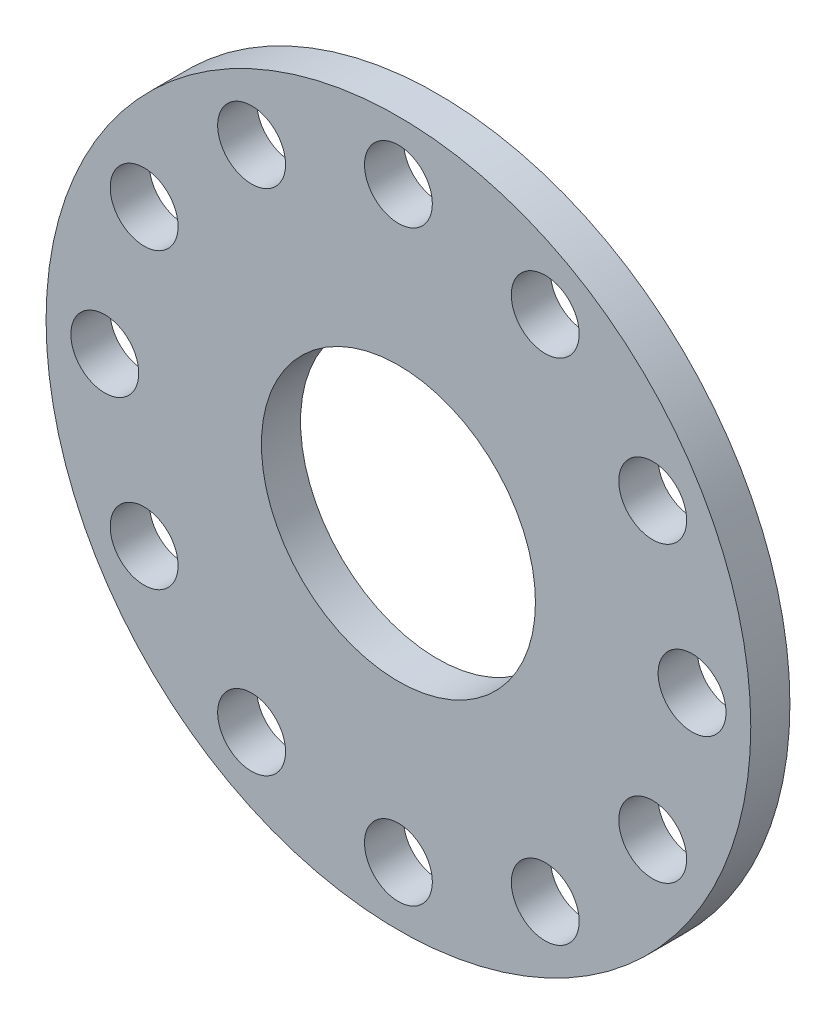
ISO-10303-21;
HEADER;
FILE_DESCRIPTION(('STEP AP214'),'2;1');
FILE_NAME('part.step','',(''),(''),'','','');
FILE_SCHEMA(('AUTOMOTIVE_DESIGN { 1 0 10303 214 1 1 1 1 }'));
ENDSEC;
DATA;
#1=APPLICATION_CONTEXT('core data for automotive mechanical design processes');
#2=APPLICATION_PROTOCOL_DEFINITION('international standard','automotive_design',2000,#1);
#3=PRODUCT_CONTEXT('',#1,'mechanical');
#4=PRODUCT('Part','Part','',(#3));
#5=PRODUCT_RELATED_PRODUCT_CATEGORY('part','',(#4));
#6=PRODUCT_DEFINITION_FORMATION('','',#4);
#7=PRODUCT_DEFINITION_CONTEXT('part definition',#1,'design');
#8=PRODUCT_DEFINITION('design','',#6,#7);
#9=PRODUCT_DEFINITION_SHAPE('','',#8);
#10=(LENGTH_UNIT() NAMED_UNIT(*) SI_UNIT(.MILLI.,.METRE.));
#11=(NAMED_UNIT(*) PLANE_ANGLE_UNIT() SI_UNIT($,.RADIAN.));
#12=(NAMED_UNIT(*) SI_UNIT($,.STERADIAN.) SOLID_ANGLE_UNIT());
#13=UNCERTAINTY_MEASURE_WITH_UNIT(LENGTH_MEASURE(1.E-05),#10,'distance_accuracy_value','');
#14=(GEOMETRIC_REPRESENTATION_CONTEXT(3) GLOBAL_UNCERTAINTY_ASSIGNED_CONTEXT((#13)) GLOBAL_UNIT_ASSIGNED_CONTEXT((#10,
#11,#12)) REPRESENTATION_CONTEXT('',''));
#15=CARTESIAN_POINT('',(0.,0.,0.));
#16=DIRECTION('',(0.,0.,1.));
#17=DIRECTION('',(1.,0.,0.));
#18=AXIS2_PLACEMENT_3D('',#15,#16,#17);
#19=CARTESIAN_POINT('',(0.,0.,3.));
#20=DIRECTION('',(0.,0.,1.));
#21=DIRECTION('',(1.,0.,0.));
#22=AXIS2_PLACEMENT_3D('',#19,#20,#21);
#23=PLANE('',#22);
#24=CARTESIAN_POINT('',(-11.2499999999954,19.4855715851526,3.));
#25=DIRECTION('',(0.,0.,1.));
#26=DIRECTION('',(1.,0.,0.));
#27=AXIS2_PLACEMENT_3D('',#24,#25,#26);
#28=CIRCLE('',#27,2.6);
#29=CARTESIAN_POINT('',(-8.64999999999536,19.4855715851526,3.));
#30=VERTEX_POINT('',#29);
#31=EDGE_CURVE('E93',#30,#30,#28,.T.);
#32=ORIENTED_EDGE('',*,*,#31,.F.);
#33=EDGE_LOOP('',(#32));
#34=FACE_BOUND('',#33,.T.);
#35=CARTESIAN_POINT('',(-22.5,4.50681159058774E-12,3.));
#36=DIRECTION('',(0.,0.,1.));
#37=DIRECTION('',(1.,0.,0.));
#38=AXIS2_PLACEMENT_3D('',#35,#36,#37);
#39=CIRCLE('',#38,2.6);
#40=CARTESIAN_POINT('',(-19.9,4.50681159058774E-12,3.));
#41=VERTEX_POINT('',#40);
#42=EDGE_CURVE('E99',#41,#41,#39,.T.);
#43=ORIENTED_EDGE('',*,*,#42,.F.);
#44=EDGE_LOOP('',(#43));
#45=FACE_BOUND('',#44,.T.);
#46=CARTESIAN_POINT('',(-11.2500000000032,-19.485571585148,3.));
#47=DIRECTION('',(0.,0.,1.));
#48=DIRECTION('',(1.,0.,0.));
#49=AXIS2_PLACEMENT_3D('',#46,#47,#48);
#50=CIRCLE('',#49,2.6);
#51=CARTESIAN_POINT('',(-8.65000000000317,-19.485571585148,3.));
#52=VERTEX_POINT('',#51);
#53=EDGE_CURVE('E105',#52,#52,#50,.T.);
#54=ORIENTED_EDGE('',*,*,#53,.F.);
#55=EDGE_LOOP('',(#54));
#56=FACE_BOUND('',#55,.T.);
#57=CARTESIAN_POINT('',(11.2499999999976,-19.4855715851513,3.));
#58=DIRECTION('',(0.,0.,1.));
#59=DIRECTION('',(1.,0.,0.));
#60=AXIS2_PLACEMENT_3D('',#57,#58,#59);
#61=CIRCLE('',#60,2.6);
#62=CARTESIAN_POINT('',(13.8499999999976,-19.4855715851513,3.));
#63=VERTEX_POINT('',#62);
#64=EDGE_CURVE('E111',#63,#63,#61,.T.);
#65=ORIENTED_EDGE('',*,*,#64,.F.);
#66=EDGE_LOOP('',(#65));
#67=FACE_BOUND('',#66,.T.);
#68=CARTESIAN_POINT('',(22.5,-1.98583625324737E-12,3.));
#69=DIRECTION('',(0.,0.,1.));
#70=DIRECTION('',(1.,0.,0.));
#71=AXIS2_PLACEMENT_3D('',#68,#69,#70);
#72=CIRCLE('',#71,2.60000000000001);
#73=CARTESIAN_POINT('',(25.1,-1.98583625324737E-12,3.));
#74=VERTEX_POINT('',#73);
#75=EDGE_CURVE('E117',#74,#74,#72,.T.);
#76=ORIENTED_EDGE('',*,*,#75,.F.);
#77=EDGE_LOOP('',(#76));
#78=FACE_BOUND('',#77,.T.);
#79=CARTESIAN_POINT('',(11.250000000001,19.4855715851493,3.));
#80=DIRECTION('',(0.,0.,1.));
#81=DIRECTION('',(1.,0.,0.));
#82=AXIS2_PLACEMENT_3D('',#79,#80,#81);
#83=CIRCLE('',#82,2.60000000000001);
#84=CARTESIAN_POINT('',(13.850000000001,19.4855715851493,3.));
#85=VERTEX_POINT('',#84);
#86=EDGE_CURVE('E87',#85,#85,#83,.T.);
#87=ORIENTED_EDGE('',*,*,#86,.F.);
#88=EDGE_LOOP('',(#87));
#89=FACE_BOUND('',#88,.T.);
#90=CARTESIAN_POINT('',(-19.4855715851519,-11.2499999999965,3.));
#91=DIRECTION('',(0.,0.,1.));
#92=DIRECTION('',(1.,0.,0.));
#93=AXIS2_PLACEMENT_3D('',#90,#91,#92);
#94=CIRCLE('',#93,2.6);
#95=CARTESIAN_POINT('',(-16.8855715851519,-11.2499999999965,3.));
#96=VERTEX_POINT('',#95);
#97=EDGE_CURVE('E72',#96,#96,#94,.T.);
#98=ORIENTED_EDGE('',*,*,#97,.F.);
#99=EDGE_LOOP('',(#98));
#100=FACE_BOUND('',#99,.T.);
#101=CARTESIAN_POINT('',(19.4855715851489,-11.2500000000017,3.));
#102=DIRECTION('',(0.,0.,1.));
#103=DIRECTION('',(1.,0.,0.));
#104=AXIS2_PLACEMENT_3D('',#101,#102,#103);
#105=CIRCLE('',#104,2.6);
#106=CARTESIAN_POINT('',(22.0855715851489,-11.2500000000017,3.));
#107=VERTEX_POINT('',#106);
#108=EDGE_CURVE('E60',#107,#107,#105,.T.);
#109=ORIENTED_EDGE('',*,*,#108,.F.);
#110=EDGE_LOOP('',(#109));
#111=FACE_BOUND('',#110,.T.);
#112=CARTESIAN_POINT('',(0.,22.5,3.));
#113=DIRECTION('',(0.,0.,1.));
#114=DIRECTION('',(1.,0.,0.));
#115=AXIS2_PLACEMENT_3D('',#112,#113,#114);
#116=CIRCLE('',#115,2.6);
#117=CARTESIAN_POINT('',(2.6,22.5,3.));
#118=VERTEX_POINT('',#117);
#119=EDGE_CURVE('E48',#118,#118,#116,.T.);
#120=ORIENTED_EDGE('',*,*,#119,.F.);
#121=EDGE_LOOP('',(#120));
#122=FACE_BOUND('',#121,.T.);
#123=CARTESIAN_POINT('',(0.,0.,3.));
#124=DIRECTION('',(0.,0.,1.));
#125=DIRECTION('',(1.,0.,0.));
#126=AXIS2_PLACEMENT_3D('',#123,#124,#125);
#127=CIRCLE('',#126,27.);
#128=CARTESIAN_POINT('',(27.,0.,3.));
#129=VERTEX_POINT('',#128);
#130=EDGE_CURVE('E10',#129,#129,#127,.T.);
#131=ORIENTED_EDGE('',*,*,#130,.T.);
#132=EDGE_LOOP('',(#131));
#133=FACE_BOUND('',#132,.T.);
#134=CARTESIAN_POINT('',(0.,0.,3.));
#135=DIRECTION('',(0.,0.,1.));
#136=DIRECTION('',(1.,0.,0.));
#137=AXIS2_PLACEMENT_3D('',#134,#135,#136);
#138=CIRCLE('',#137,10.5);
#139=CARTESIAN_POINT('',(10.5,0.,3.));
#140=VERTEX_POINT('',#139);
#141=EDGE_CURVE('E43',#140,#140,#138,.T.);
#142=ORIENTED_EDGE('',*,*,#141,.F.);
#143=EDGE_LOOP('',(#142));
#144=FACE_BOUND('',#143,.T.);
#145=CARTESIAN_POINT('',(19.4855715851504,11.2499999999991,3.));
#146=DIRECTION('',(0.,0.,1.));
#147=DIRECTION('',(1.,0.,0.));
#148=AXIS2_PLACEMENT_3D('',#145,#146,#147);
#149=CIRCLE('',#148,2.6);
#150=CARTESIAN_POINT('',(22.0855715851504,11.2499999999991,3.));
#151=VERTEX_POINT('',#150);
#152=EDGE_CURVE('E54',#151,#151,#149,.T.);
#153=ORIENTED_EDGE('',*,*,#152,.F.);
#154=EDGE_LOOP('',(#153));
#155=FACE_BOUND('',#154,.T.);
#156=CARTESIAN_POINT('',(-3.01483072563309E-12,-22.5,3.));
#157=DIRECTION('',(0.,0.,1.));
#158=DIRECTION('',(1.,0.,0.));
#159=AXIS2_PLACEMENT_3D('',#156,#157,#158);
#160=CIRCLE('',#159,2.6);
#161=CARTESIAN_POINT('',(2.59999999999699,-22.5,3.));
#162=VERTEX_POINT('',#161);
#163=EDGE_CURVE('E66',#162,#162,#160,.T.);
#164=ORIENTED_EDGE('',*,*,#163,.F.);
#165=EDGE_LOOP('',(#164));
#166=FACE_BOUND('',#165,.T.);
#167=CARTESIAN_POINT('',(-19.4855715851474,11.2500000000044,3.));
#168=DIRECTION('',(0.,0.,1.));
#169=DIRECTION('',(1.,0.,0.));
#170=AXIS2_PLACEMENT_3D('',#167,#168,#169);
#171=CIRCLE('',#170,2.6);
#172=CARTESIAN_POINT('',(-16.8855715851474,11.2500000000044,3.));
#173=VERTEX_POINT('',#172);
#174=EDGE_CURVE('E78',#173,#173,#171,.T.);
#175=ORIENTED_EDGE('',*,*,#174,.F.);
#176=EDGE_LOOP('',(#175));
#177=FACE_BOUND('',#176,.T.);
#178=ADVANCED_FACE('F32',(#34,#45,#56,#67,#78,#89,#100,#111,#122,#133,#144,#155,#166,#177),#23,.T.);
#179=CARTESIAN_POINT('',(0.,0.,0.));
#180=DIRECTION('',(0.,0.,1.));
#181=DIRECTION('',(1.,0.,0.));
#182=AXIS2_PLACEMENT_3D('',#179,#180,#181);
#183=PLANE('',#182);
#184=CARTESIAN_POINT('',(-11.2499999999954,19.4855715851526,0.));
#185=DIRECTION('',(0.,0.,1.));
#186=DIRECTION('',(1.,0.,0.));
#187=AXIS2_PLACEMENT_3D('',#184,#185,#186);
#188=CIRCLE('',#187,2.6);
#189=CARTESIAN_POINT('',(-8.64999999999536,19.4855715851526,0.));
#190=VERTEX_POINT('',#189);
#191=EDGE_CURVE('E96',#190,#190,#188,.T.);
#192=ORIENTED_EDGE('',*,*,#191,.T.);
#193=EDGE_LOOP('',(#192));
#194=FACE_BOUND('',#193,.T.);
#195=CARTESIAN_POINT('',(-22.5,4.50681159058774E-12,0.));
#196=DIRECTION('',(0.,0.,1.));
#197=DIRECTION('',(1.,0.,0.));
#198=AXIS2_PLACEMENT_3D('',#195,#196,#197);
#199=CIRCLE('',#198,2.6);
#200=CARTESIAN_POINT('',(-19.9,4.50681159058774E-12,0.));
#201=VERTEX_POINT('',#200);
#202=EDGE_CURVE('E102',#201,#201,#199,.T.);
#203=ORIENTED_EDGE('',*,*,#202,.T.);
#204=EDGE_LOOP('',(#203));
#205=FACE_BOUND('',#204,.T.);
#206=CARTESIAN_POINT('',(-11.2500000000032,-19.485571585148,0.));
#207=DIRECTION('',(0.,0.,1.));
#208=DIRECTION('',(1.,0.,0.));
#209=AXIS2_PLACEMENT_3D('',#206,#207,#208);
#210=CIRCLE('',#209,2.6);
#211=CARTESIAN_POINT('',(-8.65000000000317,-19.485571585148,0.));
#212=VERTEX_POINT('',#211);
#213=EDGE_CURVE('E108',#212,#212,#210,.T.);
#214=ORIENTED_EDGE('',*,*,#213,.T.);
#215=EDGE_LOOP('',(#214));
#216=FACE_BOUND('',#215,.T.);
#217=CARTESIAN_POINT('',(11.2499999999976,-19.4855715851513,0.));
#218=DIRECTION('',(0.,0.,1.));
#219=DIRECTION('',(1.,0.,0.));
#220=AXIS2_PLACEMENT_3D('',#217,#218,#219);
#221=CIRCLE('',#220,2.6);
#222=CARTESIAN_POINT('',(13.8499999999976,-19.4855715851513,0.));
#223=VERTEX_POINT('',#222);
#224=EDGE_CURVE('E114',#223,#223,#221,.T.);
#225=ORIENTED_EDGE('',*,*,#224,.T.);
#226=EDGE_LOOP('',(#225));
#227=FACE_BOUND('',#226,.T.);
#228=CARTESIAN_POINT('',(22.5,-1.98583625324737E-12,0.));
#229=DIRECTION('',(0.,0.,1.));
#230=DIRECTION('',(1.,0.,0.));
#231=AXIS2_PLACEMENT_3D('',#228,#229,#230);
#232=CIRCLE('',#231,2.60000000000001);
#233=CARTESIAN_POINT('',(25.1,-1.98583625324737E-12,0.));
#234=VERTEX_POINT('',#233);
#235=EDGE_CURVE('E90',#234,#234,#232,.T.);
#236=ORIENTED_EDGE('',*,*,#235,.T.);
#237=EDGE_LOOP('',(#236));
#238=FACE_BOUND('',#237,.T.);
#239=CARTESIAN_POINT('',(11.250000000001,19.4855715851493,0.));
#240=DIRECTION('',(0.,0.,1.));
#241=DIRECTION('',(1.,0.,0.));
#242=AXIS2_PLACEMENT_3D('',#239,#240,#241);
#243=CIRCLE('',#242,2.60000000000001);
#244=CARTESIAN_POINT('',(13.850000000001,19.4855715851493,0.));
#245=VERTEX_POINT('',#244);
#246=EDGE_CURVE('E84',#245,#245,#243,.T.);
#247=ORIENTED_EDGE('',*,*,#246,.T.);
#248=EDGE_LOOP('',(#247));
#249=FACE_BOUND('',#248,.T.);
#250=CARTESIAN_POINT('',(0.,0.,0.));
#251=DIRECTION('',(0.,0.,1.));
#252=DIRECTION('',(1.,0.,0.));
#253=AXIS2_PLACEMENT_3D('',#250,#251,#252);
#254=CIRCLE('',#253,27.);
#255=CARTESIAN_POINT('',(27.,0.,0.));
#256=VERTEX_POINT('',#255);
#257=EDGE_CURVE('E36',#256,#256,#254,.T.);
#258=ORIENTED_EDGE('',*,*,#257,.F.);
#259=EDGE_LOOP('',(#258));
#260=FACE_BOUND('',#259,.T.);
#261=CARTESIAN_POINT('',(0.,0.,0.));
#262=DIRECTION('',(0.,0.,1.));
#263=DIRECTION('',(1.,0.,0.));
#264=AXIS2_PLACEMENT_3D('',#261,#262,#263);
#265=CIRCLE('',#264,10.5);
#266=CARTESIAN_POINT('',(10.5,0.,0.));
#267=VERTEX_POINT('',#266);
#268=EDGE_CURVE('E45',#267,#267,#265,.T.);
#269=ORIENTED_EDGE('',*,*,#268,.T.);
#270=EDGE_LOOP('',(#269));
#271=FACE_BOUND('',#270,.T.);
#272=CARTESIAN_POINT('',(0.,22.5,0.));
#273=DIRECTION('',(0.,0.,1.));
#274=DIRECTION('',(1.,0.,0.));
#275=AXIS2_PLACEMENT_3D('',#272,#273,#274);
#276=CIRCLE('',#275,2.6);
#277=CARTESIAN_POINT('',(2.6,22.5,0.));
#278=VERTEX_POINT('',#277);
#279=EDGE_CURVE('E51',#278,#278,#276,.T.);
#280=ORIENTED_EDGE('',*,*,#279,.T.);
#281=EDGE_LOOP('',(#280));
#282=FACE_BOUND('',#281,.T.);
#283=CARTESIAN_POINT('',(19.4855715851504,11.2499999999991,0.));
#284=DIRECTION('',(0.,0.,1.));
#285=DIRECTION('',(1.,0.,0.));
#286=AXIS2_PLACEMENT_3D('',#283,#284,#285);
#287=CIRCLE('',#286,2.6);
#288=CARTESIAN_POINT('',(22.0855715851504,11.2499999999991,0.));
#289=VERTEX_POINT('',#288);
#290=EDGE_CURVE('E57',#289,#289,#287,.T.);
#291=ORIENTED_EDGE('',*,*,#290,.T.);
#292=EDGE_LOOP('',(#291));
#293=FACE_BOUND('',#292,.T.);
#294=CARTESIAN_POINT('',(19.4855715851489,-11.2500000000017,0.));
#295=DIRECTION('',(0.,0.,1.));
#296=DIRECTION('',(1.,0.,0.));
#297=AXIS2_PLACEMENT_3D('',#294,#295,#296);
#298=CIRCLE('',#297,2.6);
#299=CARTESIAN_POINT('',(22.0855715851489,-11.2500000000017,0.));
#300=VERTEX_POINT('',#299);
#301=EDGE_CURVE('E63',#300,#300,#298,.T.);
#302=ORIENTED_EDGE('',*,*,#301,.T.);
#303=EDGE_LOOP('',(#302));
#304=FACE_BOUND('',#303,.T.);
#305=CARTESIAN_POINT('',(-3.01483072563309E-12,-22.5,0.));
#306=DIRECTION('',(0.,0.,1.));
#307=DIRECTION('',(1.,0.,0.));
#308=AXIS2_PLACEMENT_3D('',#305,#306,#307);
#309=CIRCLE('',#308,2.6);
#310=CARTESIAN_POINT('',(2.59999999999699,-22.5,0.));
#311=VERTEX_POINT('',#310);
#312=EDGE_CURVE('E69',#311,#311,#309,.T.);
#313=ORIENTED_EDGE('',*,*,#312,.T.);
#314=EDGE_LOOP('',(#313));
#315=FACE_BOUND('',#314,.T.);
#316=CARTESIAN_POINT('',(-19.4855715851519,-11.2499999999965,0.));
#317=DIRECTION('',(0.,0.,1.));
#318=DIRECTION('',(1.,0.,0.));
#319=AXIS2_PLACEMENT_3D('',#316,#317,#318);
#320=CIRCLE('',#319,2.6);
#321=CARTESIAN_POINT('',(-16.8855715851519,-11.2499999999965,0.));
#322=VERTEX_POINT('',#321);
#323=EDGE_CURVE('E75',#322,#322,#320,.T.);
#324=ORIENTED_EDGE('',*,*,#323,.T.);
#325=EDGE_LOOP('',(#324));
#326=FACE_BOUND('',#325,.T.);
#327=CARTESIAN_POINT('',(-19.4855715851474,11.2500000000044,0.));
#328=DIRECTION('',(0.,0.,1.));
#329=DIRECTION('',(1.,0.,0.));
#330=AXIS2_PLACEMENT_3D('',#327,#328,#329);
#331=CIRCLE('',#330,2.6);
#332=CARTESIAN_POINT('',(-16.8855715851474,11.2500000000044,0.));
#333=VERTEX_POINT('',#332);
#334=EDGE_CURVE('E81',#333,#333,#331,.T.);
#335=ORIENTED_EDGE('',*,*,#334,.T.);
#336=EDGE_LOOP('',(#335));
#337=FACE_BOUND('',#336,.T.);
#338=ADVANCED_FACE('F123',(#194,#205,#216,#227,#238,#249,#260,#271,#282,#293,#304,#315,#326,
#337),#183,.F.);
#339=CARTESIAN_POINT('',(0.,0.,3.));
#340=DIRECTION('',(0.,0.,-1.));
#341=DIRECTION('',(-1.,0.,0.));
#342=AXIS2_PLACEMENT_3D('',#339,#340,#341);
#343=CYLINDRICAL_SURFACE('',#342,27.);
#344=ORIENTED_EDGE('',*,*,#130,.F.);
#345=EDGE_LOOP('',(#344));
#346=FACE_BOUND('',#345,.T.);
#347=ORIENTED_EDGE('',*,*,#257,.T.);
#348=EDGE_LOOP('',(#347));
#349=FACE_BOUND('',#348,.T.);
#350=ADVANCED_FACE('F34',(#346,#349),#343,.T.);
#351=CARTESIAN_POINT('',(0.,0.,3.));
#352=DIRECTION('',(0.,0.,-1.));
#353=DIRECTION('',(-1.,0.,0.));
#354=AXIS2_PLACEMENT_3D('',#351,#352,#353);
#355=CYLINDRICAL_SURFACE('',#354,10.5);
#356=ORIENTED_EDGE('',*,*,#141,.T.);
#357=EDGE_LOOP('',(#356));
#358=FACE_BOUND('',#357,.T.);
#359=ORIENTED_EDGE('',*,*,#268,.F.);
#360=EDGE_LOOP('',(#359));
#361=FACE_BOUND('',#360,.T.);
#362=ADVANCED_FACE('F166',(#358,#361),#355,.F.);
#363=CARTESIAN_POINT('',(0.,22.5,3.));
#364=DIRECTION('',(0.,0.,-1.));
#365=DIRECTION('',(-1.,0.,0.));
#366=AXIS2_PLACEMENT_3D('',#363,#364,#365);
#367=CYLINDRICAL_SURFACE('',#366,2.6);
#368=ORIENTED_EDGE('',*,*,#119,.T.);
#369=EDGE_LOOP('',(#368));
#370=FACE_BOUND('',#369,.T.);
#371=ORIENTED_EDGE('',*,*,#279,.F.);
#372=EDGE_LOOP('',(#371));
#373=FACE_BOUND('',#372,.T.);
#374=ADVANCED_FACE('F172',(#370,#373),#367,.F.);
#375=CARTESIAN_POINT('',(19.4855715851504,11.2499999999991,3.));
#376=DIRECTION('',(0.,0.,-1.));
#377=DIRECTION('',(-1.,0.,0.));
#378=AXIS2_PLACEMENT_3D('',#375,#376,#377);
#379=CYLINDRICAL_SURFACE('',#378,2.6);
#380=ORIENTED_EDGE('',*,*,#152,.T.);
#381=EDGE_LOOP('',(#380));
#382=FACE_BOUND('',#381,.T.);
#383=ORIENTED_EDGE('',*,*,#290,.F.);
#384=EDGE_LOOP('',(#383));
#385=FACE_BOUND('',#384,.T.);
#386=ADVANCED_FACE('F176',(#382,#385),#379,.F.);
#387=CARTESIAN_POINT('',(19.4855715851489,-11.2500000000017,3.));
#388=DIRECTION('',(0.,0.,-1.));
#389=DIRECTION('',(-1.,0.,0.));
#390=AXIS2_PLACEMENT_3D('',#387,#388,#389);
#391=CYLINDRICAL_SURFACE('',#390,2.6);
#392=ORIENTED_EDGE('',*,*,#108,.T.);
#393=EDGE_LOOP('',(#392));
#394=FACE_BOUND('',#393,.T.);
#395=ORIENTED_EDGE('',*,*,#301,.F.);
#396=EDGE_LOOP('',(#395));
#397=FACE_BOUND('',#396,.T.);
#398=ADVANCED_FACE('F180',(#394,#397),#391,.F.);
#399=CARTESIAN_POINT('',(-3.01483072563309E-12,-22.5,3.));
#400=DIRECTION('',(0.,0.,-1.));
#401=DIRECTION('',(-1.,0.,0.));
#402=AXIS2_PLACEMENT_3D('',#399,#400,#401);
#403=CYLINDRICAL_SURFACE('',#402,2.6);
#404=ORIENTED_EDGE('',*,*,#163,.T.);
#405=EDGE_LOOP('',(#404));
#406=FACE_BOUND('',#405,.T.);
#407=ORIENTED_EDGE('',*,*,#312,.F.);
#408=EDGE_LOOP('',(#407));
#409=FACE_BOUND('',#408,.T.);
#410=ADVANCED_FACE('F184',(#406,#409),#403,.F.);
#411=CARTESIAN_POINT('',(-19.4855715851519,-11.2499999999965,3.));
#412=DIRECTION('',(0.,0.,-1.));
#413=DIRECTION('',(-1.,0.,0.));
#414=AXIS2_PLACEMENT_3D('',#411,#412,#413);
#415=CYLINDRICAL_SURFACE('',#414,2.6);
#416=ORIENTED_EDGE('',*,*,#97,.T.);
#417=EDGE_LOOP('',(#416));
#418=FACE_BOUND('',#417,.T.);
#419=ORIENTED_EDGE('',*,*,#323,.F.);
#420=EDGE_LOOP('',(#419));
#421=FACE_BOUND('',#420,.T.);
#422=ADVANCED_FACE('F157',(#418,#421),#415,.F.);
#423=CARTESIAN_POINT('',(-19.4855715851474,11.2500000000044,3.));
#424=DIRECTION('',(0.,0.,-1.));
#425=DIRECTION('',(-1.,0.,0.));
#426=AXIS2_PLACEMENT_3D('',#423,#424,#425);
#427=CYLINDRICAL_SURFACE('',#426,2.6);
#428=ORIENTED_EDGE('',*,*,#174,.T.);
#429=EDGE_LOOP('',(#428));
#430=FACE_BOUND('',#429,.T.);
#431=ORIENTED_EDGE('',*,*,#334,.F.);
#432=EDGE_LOOP('',(#431));
#433=FACE_BOUND('',#432,.T.);
#434=ADVANCED_FACE('F154',(#430,#433),#427,.F.);
#435=CARTESIAN_POINT('',(11.250000000001,19.4855715851493,0.));
#436=DIRECTION('',(0.,0.,1.));
#437=DIRECTION('',(1.,0.,0.));
#438=AXIS2_PLACEMENT_3D('',#435,#436,#437);
#439=CYLINDRICAL_SURFACE('',#438,2.60000000000001);
#440=ORIENTED_EDGE('',*,*,#246,.F.);
#441=EDGE_LOOP('',(#440));
#442=FACE_BOUND('',#441,.T.);
#443=ORIENTED_EDGE('',*,*,#86,.T.);
#444=EDGE_LOOP('',(#443));
#445=FACE_BOUND('',#444,.T.);
#446=ADVANCED_FACE('F130',(#442,#445),#439,.F.);
#447=CARTESIAN_POINT('',(22.5,-1.98583625324737E-12,0.));
#448=DIRECTION('',(0.,0.,1.));
#449=DIRECTION('',(1.,0.,0.));
#450=AXIS2_PLACEMENT_3D('',#447,#448,#449);
#451=CYLINDRICAL_SURFACE('',#450,2.60000000000001);
#452=ORIENTED_EDGE('',*,*,#235,.F.);
#453=EDGE_LOOP('',(#452));
#454=FACE_BOUND('',#453,.T.);
#455=ORIENTED_EDGE('',*,*,#75,.T.);
#456=EDGE_LOOP('',(#455));
#457=FACE_BOUND('',#456,.T.);
#458=ADVANCED_FACE('F126',(#454,#457),#451,.F.);
#459=CARTESIAN_POINT('',(11.2499999999976,-19.4855715851513,0.));
#460=DIRECTION('',(0.,0.,1.));
#461=DIRECTION('',(1.,0.,0.));
#462=AXIS2_PLACEMENT_3D('',#459,#460,#461);
#463=CYLINDRICAL_SURFACE('',#462,2.6);
#464=ORIENTED_EDGE('',*,*,#224,.F.);
#465=EDGE_LOOP('',(#464));
#466=FACE_BOUND('',#465,.T.);
#467=ORIENTED_EDGE('',*,*,#64,.T.);
#468=EDGE_LOOP('',(#467));
#469=FACE_BOUND('',#468,.T.);
#470=ADVANCED_FACE('F129',(#466,#469),#463,.F.);
#471=CARTESIAN_POINT('',(-11.2500000000032,-19.485571585148,0.));
#472=DIRECTION('',(0.,0.,1.));
#473=DIRECTION('',(1.,0.,0.));
#474=AXIS2_PLACEMENT_3D('',#471,#472,#473);
#475=CYLINDRICAL_SURFACE('',#474,2.6);
#476=ORIENTED_EDGE('',*,*,#213,.F.);
#477=EDGE_LOOP('',(#476));
#478=FACE_BOUND('',#477,.T.);
#479=ORIENTED_EDGE('',*,*,#53,.T.);
#480=EDGE_LOOP('',(#479));
#481=FACE_BOUND('',#480,.T.);
#482=ADVANCED_FACE('F202',(#478,#481),#475,.F.);
#483=CARTESIAN_POINT('',(-22.5,4.50681159058774E-12,0.));
#484=DIRECTION('',(0.,0.,1.));
#485=DIRECTION('',(1.,0.,0.));
#486=AXIS2_PLACEMENT_3D('',#483,#484,#485);
#487=CYLINDRICAL_SURFACE('',#486,2.6);
#488=ORIENTED_EDGE('',*,*,#202,.F.);
#489=EDGE_LOOP('',(#488));
#490=FACE_BOUND('',#489,.T.);
#491=ORIENTED_EDGE('',*,*,#42,.T.);
#492=EDGE_LOOP('',(#491));
#493=FACE_BOUND('',#492,.T.);
#494=ADVANCED_FACE('F198',(#490,#493),#487,.F.);
#495=CARTESIAN_POINT('',(-11.2499999999954,19.4855715851526,0.));
#496=DIRECTION('',(0.,0.,1.));
#497=DIRECTION('',(1.,0.,0.));
#498=AXIS2_PLACEMENT_3D('',#495,#496,#497);
#499=CYLINDRICAL_SURFACE('',#498,2.6);
#500=ORIENTED_EDGE('',*,*,#191,.F.);
#501=EDGE_LOOP('',(#500));
#502=FACE_BOUND('',#501,.T.);
#503=ORIENTED_EDGE('',*,*,#31,.T.);
#504=EDGE_LOOP('',(#503));
#505=FACE_BOUND('',#504,.T.);
#506=ADVANCED_FACE('F195',(#502,#505),#499,.F.);
#507=CLOSED_SHELL('',(#178,#338,#350,#362,#374,#386,#398,#410,#422,#434,#446,#458,#470,#482,
#494,#506));
#508=MANIFOLD_SOLID_BREP('B2',#507);
#509=ADVANCED_BREP_SHAPE_REPRESENTATION('',(#18,#508),#14);
#510=SHAPE_DEFINITION_REPRESENTATION(#9,#509);
ENDSEC;
END-ISO-10303-21;
